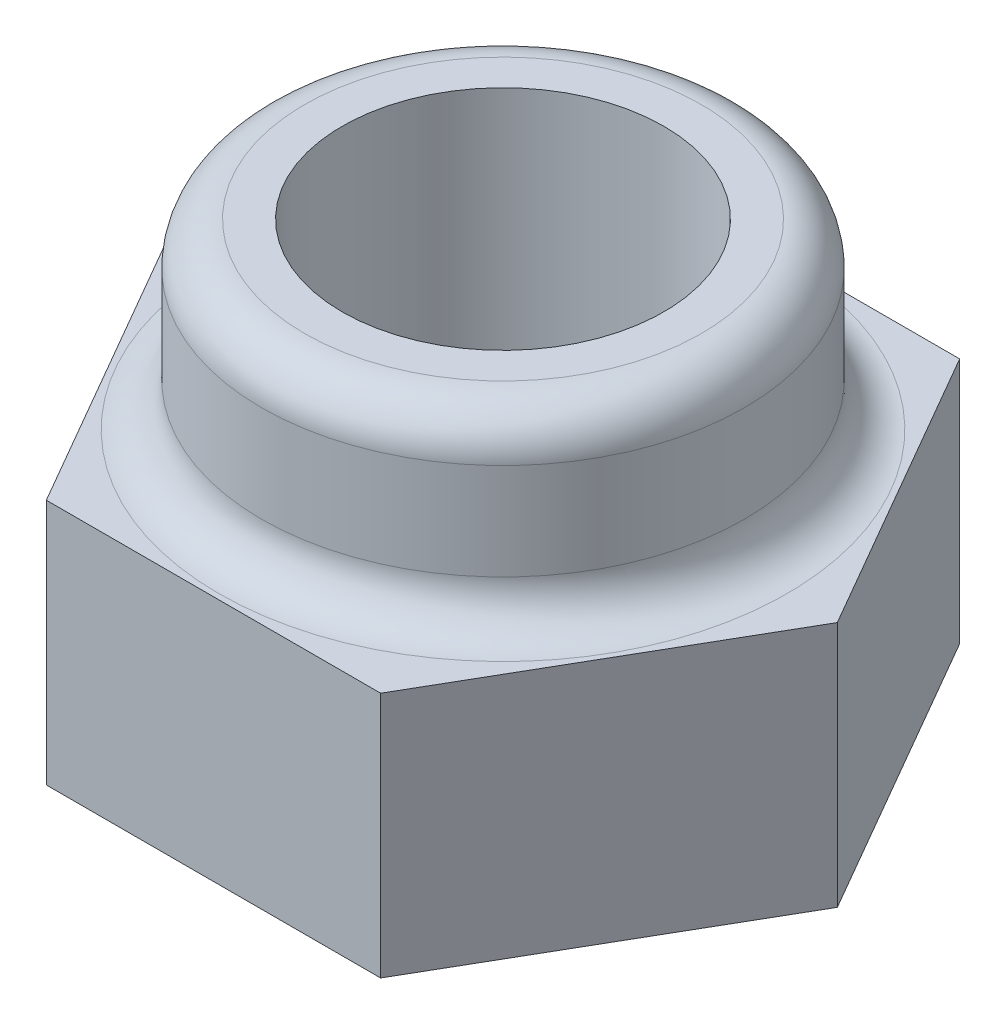
ISO-10303-21;
HEADER;
FILE_DESCRIPTION(('STEP AP214'),'2;1');
FILE_NAME('part.step','',(''),(''),'','','');
FILE_SCHEMA(('AUTOMOTIVE_DESIGN { 1 0 10303 214 1 1 1 1 }'));
ENDSEC;
DATA;
#1=APPLICATION_CONTEXT('core data for automotive mechanical design processes');
#2=APPLICATION_PROTOCOL_DEFINITION('international standard','automotive_design',2000,#1);
#3=PRODUCT_CONTEXT('',#1,'mechanical');
#4=PRODUCT('Part','Part','',(#3));
#5=PRODUCT_RELATED_PRODUCT_CATEGORY('part','',(#4));
#6=PRODUCT_DEFINITION_FORMATION('','',#4);
#7=PRODUCT_DEFINITION_CONTEXT('part definition',#1,'design');
#8=PRODUCT_DEFINITION('design','',#6,#7);
#9=PRODUCT_DEFINITION_SHAPE('','',#8);
#10=(LENGTH_UNIT() NAMED_UNIT(*) SI_UNIT(.MILLI.,.METRE.));
#11=(NAMED_UNIT(*) PLANE_ANGLE_UNIT() SI_UNIT($,.RADIAN.));
#12=(NAMED_UNIT(*) SI_UNIT($,.STERADIAN.) SOLID_ANGLE_UNIT());
#13=UNCERTAINTY_MEASURE_WITH_UNIT(LENGTH_MEASURE(1.E-05),#10,'distance_accuracy_value','');
#14=(GEOMETRIC_REPRESENTATION_CONTEXT(3) GLOBAL_UNCERTAINTY_ASSIGNED_CONTEXT((#13)) GLOBAL_UNIT_ASSIGNED_CONTEXT((#10,
#11,#12)) REPRESENTATION_CONTEXT('',''));
#15=CARTESIAN_POINT('',(0.,0.,0.));
#16=DIRECTION('',(0.,0.,1.));
#17=DIRECTION('',(1.,0.,0.));
#18=AXIS2_PLACEMENT_3D('',#15,#16,#17);
#19=CARTESIAN_POINT('',(0.,2.3,0.));
#20=DIRECTION('',(0.,1.,0.));
#21=DIRECTION('',(0.,0.,1.));
#22=AXIS2_PLACEMENT_3D('',#19,#20,#21);
#23=PLANE('',#22);
#24=CARTESIAN_POINT('',(0.,2.3,0.));
#25=DIRECTION('',(0.,1.,0.));
#26=DIRECTION('',(0.,0.,1.));
#27=AXIS2_PLACEMENT_3D('',#24,#25,#26);
#28=CIRCLE('',#27,2.65);
#29=CARTESIAN_POINT('',(0.,2.3,2.65));
#30=VERTEX_POINT('',#29);
#31=EDGE_CURVE('E11',#30,#30,#28,.F.);
#32=ORIENTED_EDGE('',*,*,#31,.T.);
#33=EDGE_LOOP('',(#32));
#34=FACE_BOUND('',#33,.T.);
#35=DIRECTION('',(0.5,0.,-0.866025403784439));
#36=VECTOR('',#35,1.);
#37=CARTESIAN_POINT('',(1.55884572681199,2.3,2.7));
#38=LINE('',#37,#36);
#39=CARTESIAN_POINT('',(1.55884572681199,2.3,2.7));
#40=VERTEX_POINT('',#39);
#41=CARTESIAN_POINT('',(3.11769145362398,2.3,0.));
#42=VERTEX_POINT('',#41);
#43=EDGE_CURVE('E131',#40,#42,#38,.T.);
#44=ORIENTED_EDGE('',*,*,#43,.T.);
#45=DIRECTION('',(-0.5,0.,-0.866025403784439));
#46=VECTOR('',#45,1.);
#47=CARTESIAN_POINT('',(3.11769145362398,2.3,0.));
#48=LINE('',#47,#46);
#49=CARTESIAN_POINT('',(1.55884572681198,2.3,-2.70000000000001));
#50=VERTEX_POINT('',#49);
#51=EDGE_CURVE('E90',#42,#50,#48,.T.);
#52=ORIENTED_EDGE('',*,*,#51,.T.);
#53=DIRECTION('',(-1.,0.,0.));
#54=VECTOR('',#53,1.);
#55=CARTESIAN_POINT('',(1.55884572681198,2.3,-2.70000000000001));
#56=LINE('',#55,#54);
#57=CARTESIAN_POINT('',(-1.55884572681199,2.3,-2.70000000000001));
#58=VERTEX_POINT('',#57);
#59=EDGE_CURVE('E102',#50,#58,#56,.T.);
#60=ORIENTED_EDGE('',*,*,#59,.T.);
#61=DIRECTION('',(-0.5,0.,0.866025403784439));
#62=VECTOR('',#61,1.);
#63=CARTESIAN_POINT('',(-1.55884572681199,2.3,-2.70000000000001));
#64=LINE('',#63,#62);
#65=CARTESIAN_POINT('',(-3.11769145362398,2.3,0.));
#66=VERTEX_POINT('',#65);
#67=EDGE_CURVE('E97',#58,#66,#64,.T.);
#68=ORIENTED_EDGE('',*,*,#67,.T.);
#69=DIRECTION('',(0.5,0.,0.866025403784439));
#70=VECTOR('',#69,1.);
#71=CARTESIAN_POINT('',(-3.11769145362398,2.3,0.));
#72=LINE('',#71,#70);
#73=CARTESIAN_POINT('',(-1.55884572681199,2.3,2.7));
#74=VERTEX_POINT('',#73);
#75=EDGE_CURVE('E100',#66,#74,#72,.T.);
#76=ORIENTED_EDGE('',*,*,#75,.T.);
#77=DIRECTION('',(1.,0.,0.));
#78=VECTOR('',#77,1.);
#79=CARTESIAN_POINT('',(-1.55884572681199,2.3,2.7));
#80=LINE('',#79,#78);
#81=EDGE_CURVE('E52',#74,#40,#80,.T.);
#82=ORIENTED_EDGE('',*,*,#81,.T.);
#83=EDGE_LOOP('',(#44,#52,#60,#68,#76,#82));
#84=FACE_BOUND('',#83,.T.);
#85=ADVANCED_FACE('F35',(#34,#84),#23,.T.);
#86=CARTESIAN_POINT('',(0.,0.,0.));
#87=DIRECTION('',(0.,1.,0.));
#88=DIRECTION('',(0.,0.,1.));
#89=AXIS2_PLACEMENT_3D('',#86,#87,#88);
#90=PLANE('',#89);
#91=DIRECTION('',(0.5,0.,-0.866025403784439));
#92=VECTOR('',#91,1.);
#93=CARTESIAN_POINT('',(1.55884572681199,0.,2.7));
#94=LINE('',#93,#92);
#95=CARTESIAN_POINT('',(1.55884572681199,0.,2.7));
#96=VERTEX_POINT('',#95);
#97=CARTESIAN_POINT('',(3.11769145362398,0.,0.));
#98=VERTEX_POINT('',#97);
#99=EDGE_CURVE('E120',#96,#98,#94,.T.);
#100=ORIENTED_EDGE('',*,*,#99,.F.);
#101=DIRECTION('',(1.,0.,0.));
#102=VECTOR('',#101,1.);
#103=CARTESIAN_POINT('',(-1.55884572681199,0.,2.7));
#104=LINE('',#103,#102);
#105=CARTESIAN_POINT('',(-1.55884572681199,0.,2.7));
#106=VERTEX_POINT('',#105);
#107=EDGE_CURVE('E81',#106,#96,#104,.T.);
#108=ORIENTED_EDGE('',*,*,#107,.F.);
#109=DIRECTION('',(0.5,0.,0.866025403784439));
#110=VECTOR('',#109,1.);
#111=CARTESIAN_POINT('',(-3.11769145362398,0.,0.));
#112=LINE('',#111,#110);
#113=CARTESIAN_POINT('',(-3.11769145362398,0.,0.));
#114=VERTEX_POINT('',#113);
#115=EDGE_CURVE('E75',#114,#106,#112,.T.);
#116=ORIENTED_EDGE('',*,*,#115,.F.);
#117=DIRECTION('',(-0.5,0.,0.866025403784439));
#118=VECTOR('',#117,1.);
#119=CARTESIAN_POINT('',(-1.55884572681199,0.,-2.70000000000001));
#120=LINE('',#119,#118);
#121=CARTESIAN_POINT('',(-1.55884572681199,0.,-2.70000000000001));
#122=VERTEX_POINT('',#121);
#123=EDGE_CURVE('E110',#122,#114,#120,.T.);
#124=ORIENTED_EDGE('',*,*,#123,.F.);
#125=DIRECTION('',(-1.,0.,0.));
#126=VECTOR('',#125,1.);
#127=CARTESIAN_POINT('',(1.55884572681198,0.,-2.70000000000001));
#128=LINE('',#127,#126);
#129=CARTESIAN_POINT('',(1.55884572681198,0.,-2.70000000000001));
#130=VERTEX_POINT('',#129);
#131=EDGE_CURVE('E126',#130,#122,#128,.T.);
#132=ORIENTED_EDGE('',*,*,#131,.F.);
#133=DIRECTION('',(-0.5,0.,-0.866025403784439));
#134=VECTOR('',#133,1.);
#135=CARTESIAN_POINT('',(3.11769145362398,0.,0.));
#136=LINE('',#135,#134);
#137=EDGE_CURVE('E123',#98,#130,#136,.T.);
#138=ORIENTED_EDGE('',*,*,#137,.F.);
#139=EDGE_LOOP('',(#100,#108,#116,#124,#132,#138));
#140=FACE_BOUND('',#139,.T.);
#141=CARTESIAN_POINT('',(0.,0.,0.));
#142=DIRECTION('',(0.,1.,0.));
#143=DIRECTION('',(0.,0.,1.));
#144=AXIS2_PLACEMENT_3D('',#141,#142,#143);
#145=CIRCLE('',#144,1.5);
#146=CARTESIAN_POINT('',(0.,0.,1.5));
#147=VERTEX_POINT('',#146);
#148=EDGE_CURVE('E124',#147,#147,#145,.T.);
#149=ORIENTED_EDGE('',*,*,#148,.T.);
#150=EDGE_LOOP('',(#149));
#151=FACE_BOUND('',#150,.T.);
#152=ADVANCED_FACE('F178',(#140,#151),#90,.F.);
#153=CARTESIAN_POINT('',(1.55884572681199,2.3,2.7));
#154=DIRECTION('',(-0.866025403784439,0.,-0.5));
#155=DIRECTION('',(-0.5,0.,0.866025403784439));
#156=AXIS2_PLACEMENT_3D('',#153,#154,#155);
#157=PLANE('',#156);
#158=ORIENTED_EDGE('',*,*,#99,.T.);
#159=DIRECTION('',(0.,-1.,0.));
#160=VECTOR('',#159,1.);
#161=CARTESIAN_POINT('',(3.11769145362398,2.3,0.));
#162=LINE('',#161,#160);
#163=EDGE_CURVE('E138',#42,#98,#162,.T.);
#164=ORIENTED_EDGE('',*,*,#163,.F.);
#165=ORIENTED_EDGE('',*,*,#43,.F.);
#166=DIRECTION('',(0.,-1.,0.));
#167=VECTOR('',#166,1.);
#168=CARTESIAN_POINT('',(1.55884572681199,2.3,2.7));
#169=LINE('',#168,#167);
#170=EDGE_CURVE('E116',#40,#96,#169,.T.);
#171=ORIENTED_EDGE('',*,*,#170,.T.);
#172=EDGE_LOOP('',(#158,#164,#165,#171));
#173=FACE_BOUND('',#172,.T.);
#174=ADVANCED_FACE('F181',(#173),#157,.F.);
#175=CARTESIAN_POINT('',(3.11769145362398,2.3,0.));
#176=DIRECTION('',(-0.866025403784439,0.,0.5));
#177=DIRECTION('',(0.5,0.,0.866025403784439));
#178=AXIS2_PLACEMENT_3D('',#175,#176,#177);
#179=PLANE('',#178);
#180=ORIENTED_EDGE('',*,*,#137,.T.);
#181=DIRECTION('',(0.,-1.,0.));
#182=VECTOR('',#181,1.);
#183=CARTESIAN_POINT('',(1.55884572681198,2.3,-2.70000000000001));
#184=LINE('',#183,#182);
#185=EDGE_CURVE('E135',#50,#130,#184,.T.);
#186=ORIENTED_EDGE('',*,*,#185,.F.);
#187=ORIENTED_EDGE('',*,*,#51,.F.);
#188=ORIENTED_EDGE('',*,*,#163,.T.);
#189=EDGE_LOOP('',(#180,#186,#187,#188));
#190=FACE_BOUND('',#189,.T.);
#191=ADVANCED_FACE('F172',(#190),#179,.F.);
#192=CARTESIAN_POINT('',(1.55884572681198,2.3,-2.70000000000001));
#193=DIRECTION('',(0.,0.,1.));
#194=DIRECTION('',(1.,0.,0.));
#195=AXIS2_PLACEMENT_3D('',#192,#193,#194);
#196=PLANE('',#195);
#197=ORIENTED_EDGE('',*,*,#131,.T.);
#198=DIRECTION('',(0.,-1.,0.));
#199=VECTOR('',#198,1.);
#200=CARTESIAN_POINT('',(-1.55884572681199,2.3,-2.70000000000001));
#201=LINE('',#200,#199);
#202=EDGE_CURVE('E111',#58,#122,#201,.T.);
#203=ORIENTED_EDGE('',*,*,#202,.F.);
#204=ORIENTED_EDGE('',*,*,#59,.F.);
#205=ORIENTED_EDGE('',*,*,#185,.T.);
#206=EDGE_LOOP('',(#197,#203,#204,#205));
#207=FACE_BOUND('',#206,.T.);
#208=ADVANCED_FACE('F175',(#207),#196,.F.);
#209=CARTESIAN_POINT('',(-1.55884572681199,2.3,-2.70000000000001));
#210=DIRECTION('',(0.866025403784439,0.,0.5));
#211=DIRECTION('',(0.5,0.,-0.866025403784439));
#212=AXIS2_PLACEMENT_3D('',#209,#210,#211);
#213=PLANE('',#212);
#214=ORIENTED_EDGE('',*,*,#123,.T.);
#215=DIRECTION('',(0.,-1.,0.));
#216=VECTOR('',#215,1.);
#217=CARTESIAN_POINT('',(-3.11769145362398,2.3,0.));
#218=LINE('',#217,#216);
#219=EDGE_CURVE('E107',#66,#114,#218,.T.);
#220=ORIENTED_EDGE('',*,*,#219,.F.);
#221=ORIENTED_EDGE('',*,*,#67,.F.);
#222=ORIENTED_EDGE('',*,*,#202,.T.);
#223=EDGE_LOOP('',(#214,#220,#221,#222));
#224=FACE_BOUND('',#223,.T.);
#225=ADVANCED_FACE('F108',(#224),#213,.F.);
#226=CARTESIAN_POINT('',(-3.11769145362398,2.3,0.));
#227=DIRECTION('',(0.866025403784439,0.,-0.5));
#228=DIRECTION('',(-0.5,0.,-0.866025403784439));
#229=AXIS2_PLACEMENT_3D('',#226,#227,#228);
#230=PLANE('',#229);
#231=ORIENTED_EDGE('',*,*,#115,.T.);
#232=DIRECTION('',(0.,-1.,0.));
#233=VECTOR('',#232,1.);
#234=CARTESIAN_POINT('',(-1.55884572681199,2.3,2.7));
#235=LINE('',#234,#233);
#236=EDGE_CURVE('E112',#74,#106,#235,.T.);
#237=ORIENTED_EDGE('',*,*,#236,.F.);
#238=ORIENTED_EDGE('',*,*,#75,.F.);
#239=ORIENTED_EDGE('',*,*,#219,.T.);
#240=EDGE_LOOP('',(#231,#237,#238,#239));
#241=FACE_BOUND('',#240,.T.);
#242=ADVANCED_FACE('F114',(#241),#230,.F.);
#243=CARTESIAN_POINT('',(-1.55884572681199,2.3,2.7));
#244=DIRECTION('',(0.,0.,-1.));
#245=DIRECTION('',(-1.,0.,0.));
#246=AXIS2_PLACEMENT_3D('',#243,#244,#245);
#247=PLANE('',#246);
#248=ORIENTED_EDGE('',*,*,#107,.T.);
#249=ORIENTED_EDGE('',*,*,#170,.F.);
#250=ORIENTED_EDGE('',*,*,#81,.F.);
#251=ORIENTED_EDGE('',*,*,#236,.T.);
#252=EDGE_LOOP('',(#248,#249,#250,#251));
#253=FACE_BOUND('',#252,.T.);
#254=ADVANCED_FACE('F182',(#253),#247,.F.);
#255=CARTESIAN_POINT('',(0.,2.3,0.));
#256=DIRECTION('',(0.,-1.,0.));
#257=DIRECTION('',(0.,0.,-1.));
#258=AXIS2_PLACEMENT_3D('',#255,#256,#257);
#259=CYLINDRICAL_SURFACE('',#258,1.5);
#260=ORIENTED_EDGE('',*,*,#148,.F.);
#261=EDGE_LOOP('',(#260));
#262=FACE_BOUND('',#261,.T.);
#263=CARTESIAN_POINT('',(0.,4.,0.));
#264=DIRECTION('',(0.,1.,0.));
#265=DIRECTION('',(0.,0.,1.));
#266=AXIS2_PLACEMENT_3D('',#263,#264,#265);
#267=CIRCLE('',#266,1.5);
#268=CARTESIAN_POINT('',(0.,4.,1.5));
#269=VERTEX_POINT('',#268);
#270=EDGE_CURVE('E163',#269,#269,#267,.T.);
#271=ORIENTED_EDGE('',*,*,#270,.T.);
#272=EDGE_LOOP('',(#271));
#273=FACE_BOUND('',#272,.T.);
#274=ADVANCED_FACE('F159',(#262,#273),#259,.F.);
#275=CARTESIAN_POINT('',(0.,4.,0.));
#276=DIRECTION('',(0.,1.,0.));
#277=DIRECTION('',(0.,0.,1.));
#278=AXIS2_PLACEMENT_3D('',#275,#276,#277);
#279=PLANE('',#278);
#280=CARTESIAN_POINT('',(0.,4.,0.));
#281=DIRECTION('',(0.,1.,0.));
#282=DIRECTION('',(0.,0.,1.));
#283=AXIS2_PLACEMENT_3D('',#280,#281,#282);
#284=CIRCLE('',#283,1.85);
#285=CARTESIAN_POINT('',(0.,4.,1.85));
#286=VERTEX_POINT('',#285);
#287=EDGE_CURVE('E140',#286,#286,#284,.T.);
#288=ORIENTED_EDGE('',*,*,#287,.T.);
#289=EDGE_LOOP('',(#288));
#290=FACE_BOUND('',#289,.T.);
#291=ORIENTED_EDGE('',*,*,#270,.F.);
#292=EDGE_LOOP('',(#291));
#293=FACE_BOUND('',#292,.T.);
#294=ADVANCED_FACE('F156',(#290,#293),#279,.T.);
#295=CARTESIAN_POINT('',(0.,4.,0.));
#296=DIRECTION('',(0.,-1.,0.));
#297=DIRECTION('',(0.,0.,-1.));
#298=AXIS2_PLACEMENT_3D('',#295,#296,#297);
#299=CYLINDRICAL_SURFACE('',#298,2.25);
#300=CARTESIAN_POINT('',(0.,3.6,0.));
#301=DIRECTION('',(0.,1.,0.));
#302=DIRECTION('',(0.,0.,1.));
#303=AXIS2_PLACEMENT_3D('',#300,#301,#302);
#304=CIRCLE('',#303,2.25);
#305=CARTESIAN_POINT('',(0.,3.6,2.25));
#306=VERTEX_POINT('',#305);
#307=EDGE_CURVE('E44',#306,#306,#304,.F.);
#308=ORIENTED_EDGE('',*,*,#307,.T.);
#309=EDGE_LOOP('',(#308));
#310=FACE_BOUND('',#309,.T.);
#311=CARTESIAN_POINT('',(0.,2.7,0.));
#312=DIRECTION('',(0.,1.,0.));
#313=DIRECTION('',(0.,0.,1.));
#314=AXIS2_PLACEMENT_3D('',#311,#312,#313);
#315=CIRCLE('',#314,2.25);
#316=CARTESIAN_POINT('',(0.,2.7,2.25));
#317=VERTEX_POINT('',#316);
#318=EDGE_CURVE('E143',#317,#317,#315,.T.);
#319=ORIENTED_EDGE('',*,*,#318,.T.);
#320=EDGE_LOOP('',(#319));
#321=FACE_BOUND('',#320,.T.);
#322=ADVANCED_FACE('F148',(#310,#321),#299,.T.);
#323=CARTESIAN_POINT('',(0.,3.6,0.));
#324=DIRECTION('',(0.,1.,0.));
#325=DIRECTION('',(0.,0.,1.));
#326=AXIS2_PLACEMENT_3D('',#323,#324,#325);
#327=TOROIDAL_SURFACE('',#326,1.85,0.4);
#328=ORIENTED_EDGE('',*,*,#307,.F.);
#329=EDGE_LOOP('',(#328));
#330=FACE_BOUND('',#329,.T.);
#331=ORIENTED_EDGE('',*,*,#287,.F.);
#332=EDGE_LOOP('',(#331));
#333=FACE_BOUND('',#332,.T.);
#334=ADVANCED_FACE('F151',(#330,#333),#327,.T.);
#335=CARTESIAN_POINT('',(0.,2.7,0.));
#336=DIRECTION('',(0.,1.,0.));
#337=DIRECTION('',(0.,0.,1.));
#338=AXIS2_PLACEMENT_3D('',#335,#336,#337);
#339=TOROIDAL_SURFACE('',#338,2.65,0.4);
#340=ORIENTED_EDGE('',*,*,#31,.F.);
#341=EDGE_LOOP('',(#340));
#342=FACE_BOUND('',#341,.T.);
#343=ORIENTED_EDGE('',*,*,#318,.F.);
#344=EDGE_LOOP('',(#343));
#345=FACE_BOUND('',#344,.T.);
#346=ADVANCED_FACE('F37',(#342,#345),#339,.F.);
#347=CLOSED_SHELL('',(#85,#152,#174,#191,#208,#225,#242,#254,#274,#294,#322,#334,#346));
#348=MANIFOLD_SOLID_BREP('B2',#347);
#349=ADVANCED_BREP_SHAPE_REPRESENTATION('',(#18,#348),#14);
#350=SHAPE_DEFINITION_REPRESENTATION(#9,#349);
ENDSEC;
END-ISO-10303-21;
